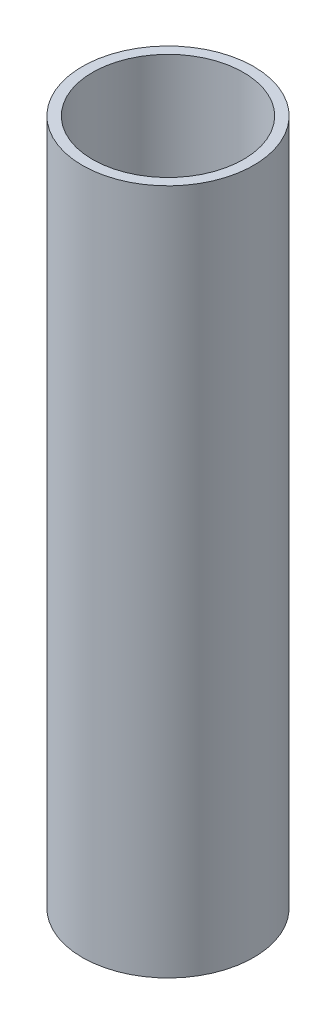
ISO-10303-21;
HEADER;
FILE_DESCRIPTION(('STEP AP214'),'2;1');
FILE_NAME('part.step','',(''),(''),'','','');
FILE_SCHEMA(('AUTOMOTIVE_DESIGN { 1 0 10303 214 1 1 1 1 }'));
ENDSEC;
DATA;
#1=APPLICATION_CONTEXT('core data for automotive mechanical design processes');
#2=APPLICATION_PROTOCOL_DEFINITION('international standard','automotive_design',2000,#1);
#3=PRODUCT_CONTEXT('',#1,'mechanical');
#4=PRODUCT('Part','Part','',(#3));
#5=PRODUCT_RELATED_PRODUCT_CATEGORY('part','',(#4));
#6=PRODUCT_DEFINITION_FORMATION('','',#4);
#7=PRODUCT_DEFINITION_CONTEXT('part definition',#1,'design');
#8=PRODUCT_DEFINITION('design','',#6,#7);
#9=PRODUCT_DEFINITION_SHAPE('','',#8);
#10=(LENGTH_UNIT() NAMED_UNIT(*) SI_UNIT(.MILLI.,.METRE.));
#11=(NAMED_UNIT(*) PLANE_ANGLE_UNIT() SI_UNIT($,.RADIAN.));
#12=(NAMED_UNIT(*) SI_UNIT($,.STERADIAN.) SOLID_ANGLE_UNIT());
#13=UNCERTAINTY_MEASURE_WITH_UNIT(LENGTH_MEASURE(1.E-05),#10,'distance_accuracy_value','');
#14=(GEOMETRIC_REPRESENTATION_CONTEXT(3) GLOBAL_UNCERTAINTY_ASSIGNED_CONTEXT((#13)) GLOBAL_UNIT_ASSIGNED_CONTEXT((#10,
#11,#12)) REPRESENTATION_CONTEXT('',''));
#15=CARTESIAN_POINT('',(0.,0.,0.));
#16=DIRECTION('',(0.,0.,1.));
#17=DIRECTION('',(1.,0.,0.));
#18=AXIS2_PLACEMENT_3D('',#15,#16,#17);
#19=CARTESIAN_POINT('',(0.,101.6,0.));
#20=DIRECTION('',(0.,1.,0.));
#21=DIRECTION('',(0.,0.,1.));
#22=AXIS2_PLACEMENT_3D('',#19,#20,#21);
#23=PLANE('',#22);
#24=CARTESIAN_POINT('',(0.,101.6,0.));
#25=DIRECTION('',(0.,1.,0.));
#26=DIRECTION('',(0.,0.,1.));
#27=AXIS2_PLACEMENT_3D('',#24,#25,#26);
#28=CIRCLE('',#27,12.6873);
#29=CARTESIAN_POINT('',(0.,101.6,12.6873));
#30=VERTEX_POINT('',#29);
#31=EDGE_CURVE('E10',#30,#30,#28,.T.);
#32=ORIENTED_EDGE('',*,*,#31,.T.);
#33=EDGE_LOOP('',(#32));
#34=FACE_BOUND('',#33,.T.);
#35=CARTESIAN_POINT('',(0.,101.6,0.));
#36=DIRECTION('',(0.,1.,0.));
#37=DIRECTION('',(0.,0.,1.));
#38=AXIS2_PLACEMENT_3D('',#35,#36,#37);
#39=CIRCLE('',#38,11.176);
#40=CARTESIAN_POINT('',(0.,101.6,11.176));
#41=VERTEX_POINT('',#40);
#42=EDGE_CURVE('E42',#41,#41,#39,.T.);
#43=ORIENTED_EDGE('',*,*,#42,.F.);
#44=EDGE_LOOP('',(#43));
#45=FACE_BOUND('',#44,.T.);
#46=ADVANCED_FACE('F31',(#34,#45),#23,.T.);
#47=CARTESIAN_POINT('',(0.,0.,0.));
#48=DIRECTION('',(0.,1.,0.));
#49=DIRECTION('',(0.,0.,1.));
#50=AXIS2_PLACEMENT_3D('',#47,#48,#49);
#51=PLANE('',#50);
#52=CARTESIAN_POINT('',(0.,0.,0.));
#53=DIRECTION('',(0.,1.,0.));
#54=DIRECTION('',(0.,0.,1.));
#55=AXIS2_PLACEMENT_3D('',#52,#53,#54);
#56=CIRCLE('',#55,12.6873);
#57=CARTESIAN_POINT('',(0.,0.,12.6873));
#58=VERTEX_POINT('',#57);
#59=EDGE_CURVE('E35',#58,#58,#56,.T.);
#60=ORIENTED_EDGE('',*,*,#59,.F.);
#61=EDGE_LOOP('',(#60));
#62=FACE_BOUND('',#61,.T.);
#63=CARTESIAN_POINT('',(0.,0.,0.));
#64=DIRECTION('',(0.,1.,0.));
#65=DIRECTION('',(0.,0.,1.));
#66=AXIS2_PLACEMENT_3D('',#63,#64,#65);
#67=CIRCLE('',#66,11.176);
#68=CARTESIAN_POINT('',(0.,0.,11.176));
#69=VERTEX_POINT('',#68);
#70=EDGE_CURVE('E44',#69,#69,#67,.T.);
#71=ORIENTED_EDGE('',*,*,#70,.T.);
#72=EDGE_LOOP('',(#71));
#73=FACE_BOUND('',#72,.T.);
#74=ADVANCED_FACE('F54',(#62,#73),#51,.F.);
#75=CARTESIAN_POINT('',(0.,101.6,0.));
#76=DIRECTION('',(0.,-1.,0.));
#77=DIRECTION('',(0.,0.,-1.));
#78=AXIS2_PLACEMENT_3D('',#75,#76,#77);
#79=CYLINDRICAL_SURFACE('',#78,12.6873);
#80=ORIENTED_EDGE('',*,*,#31,.F.);
#81=EDGE_LOOP('',(#80));
#82=FACE_BOUND('',#81,.T.);
#83=ORIENTED_EDGE('',*,*,#59,.T.);
#84=EDGE_LOOP('',(#83));
#85=FACE_BOUND('',#84,.T.);
#86=ADVANCED_FACE('F33',(#82,#85),#79,.T.);
#87=CARTESIAN_POINT('',(0.,101.6,0.));
#88=DIRECTION('',(0.,-1.,0.));
#89=DIRECTION('',(0.,0.,-1.));
#90=AXIS2_PLACEMENT_3D('',#87,#88,#89);
#91=CYLINDRICAL_SURFACE('',#90,11.176);
#92=ORIENTED_EDGE('',*,*,#42,.T.);
#93=EDGE_LOOP('',(#92));
#94=FACE_BOUND('',#93,.T.);
#95=ORIENTED_EDGE('',*,*,#70,.F.);
#96=EDGE_LOOP('',(#95));
#97=FACE_BOUND('',#96,.T.);
#98=ADVANCED_FACE('F50',(#94,#97),#91,.F.);
#99=CLOSED_SHELL('',(#46,#74,#86,#98));
#100=MANIFOLD_SOLID_BREP('B2',#99);
#101=ADVANCED_BREP_SHAPE_REPRESENTATION('',(#18,#100),#14);
#102=SHAPE_DEFINITION_REPRESENTATION(#9,#101);
ENDSEC;
END-ISO-10303-21;
